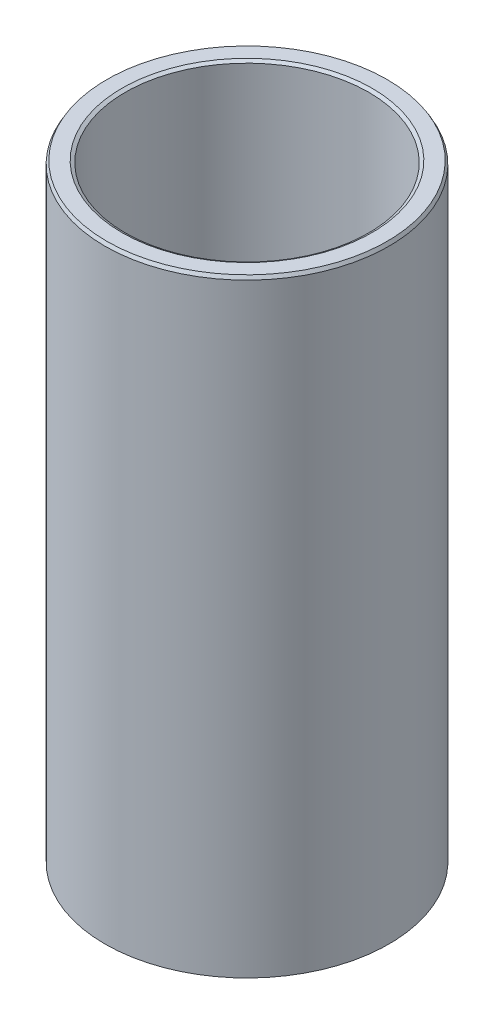
ISO-10303-21;
HEADER;
FILE_DESCRIPTION(('STEP AP214'),'2;1');
FILE_NAME('part.step','',(''),(''),'','','');
FILE_SCHEMA(('AUTOMOTIVE_DESIGN { 1 0 10303 214 1 1 1 1 }'));
ENDSEC;
DATA;
#1=APPLICATION_CONTEXT('core data for automotive mechanical design processes');
#2=APPLICATION_PROTOCOL_DEFINITION('international standard','automotive_design',2000,#1);
#3=PRODUCT_CONTEXT('',#1,'mechanical');
#4=PRODUCT('Part','Part','',(#3));
#5=PRODUCT_RELATED_PRODUCT_CATEGORY('part','',(#4));
#6=PRODUCT_DEFINITION_FORMATION('','',#4);
#7=PRODUCT_DEFINITION_CONTEXT('part definition',#1,'design');
#8=PRODUCT_DEFINITION('design','',#6,#7);
#9=PRODUCT_DEFINITION_SHAPE('','',#8);
#10=(LENGTH_UNIT() NAMED_UNIT(*) SI_UNIT(.MILLI.,.METRE.));
#11=(NAMED_UNIT(*) PLANE_ANGLE_UNIT() SI_UNIT($,.RADIAN.));
#12=(NAMED_UNIT(*) SI_UNIT($,.STERADIAN.) SOLID_ANGLE_UNIT());
#13=UNCERTAINTY_MEASURE_WITH_UNIT(LENGTH_MEASURE(1.E-05),#10,'distance_accuracy_value','');
#14=(GEOMETRIC_REPRESENTATION_CONTEXT(3) GLOBAL_UNCERTAINTY_ASSIGNED_CONTEXT((#13)) GLOBAL_UNIT_ASSIGNED_CONTEXT((#10,
#11,#12)) REPRESENTATION_CONTEXT('',''));
#15=CARTESIAN_POINT('',(0.,0.,0.));
#16=DIRECTION('',(0.,0.,1.));
#17=DIRECTION('',(1.,0.,0.));
#18=AXIS2_PLACEMENT_3D('',#15,#16,#17);
#19=CARTESIAN_POINT('',(0.,236.008714554797,0.));
#20=DIRECTION('',(0.,-1.,0.));
#21=DIRECTION('',(0.,0.,-1.));
#22=AXIS2_PLACEMENT_3D('',#19,#20,#21);
#23=CYLINDRICAL_SURFACE('',#22,55.);
#24=CARTESIAN_POINT('',(0.,0.732950047507397,0.));
#25=DIRECTION('',(0.,1.,0.));
#26=DIRECTION('',(0.,0.,1.));
#27=AXIS2_PLACEMENT_3D('',#24,#25,#26);
#28=CIRCLE('',#27,55.);
#29=CARTESIAN_POINT('',(0.,0.732950047507369,-55.));
#30=VERTEX_POINT('',#29);
#31=EDGE_CURVE('E10',#30,#30,#28,.T.);
#32=CARTESIAN_POINT('',(0.,234.739207833105,0.));
#33=DIRECTION('',(0.,1.,0.));
#34=DIRECTION('',(0.,0.,1.));
#35=AXIS2_PLACEMENT_3D('',#32,#33,#34);
#36=CIRCLE('',#35,55.);
#37=CARTESIAN_POINT('',(0.,234.739207833105,-55.));
#38=VERTEX_POINT('',#37);
#39=EDGE_CURVE('E50',#38,#38,#36,.F.);
#40=CARTESIAN_POINT('',(0.,0.732950047507369,-55.));
#41=CARTESIAN_POINT('',(0.,3.17051523277401,-55.));
#42=CARTESIAN_POINT('',(0.,5.60808041804064,-55.));
#43=CARTESIAN_POINT('',(0.,10.4832107885739,-55.));
#44=CARTESIAN_POINT('',(0.,12.9207759738406,-55.));
#45=CARTESIAN_POINT('',(0.,17.7959063443739,-55.));
#46=CARTESIAN_POINT('',(0.,20.2334715296405,-55.));
#47=CARTESIAN_POINT('',(0.,25.1086019001738,-55.));
#48=CARTESIAN_POINT('',(0.,27.5461670854404,-55.));
#49=CARTESIAN_POINT('',(0.,32.4212974559737,-55.));
#50=CARTESIAN_POINT('',(0.,34.8588626412403,-55.));
#51=CARTESIAN_POINT('',(0.,39.7339930117736,-55.));
#52=CARTESIAN_POINT('',(0.,42.1715581970403,-55.));
#53=CARTESIAN_POINT('',(0.,47.0466885675736,-55.));
#54=CARTESIAN_POINT('',(0.,49.4842537528402,-55.));
#55=CARTESIAN_POINT('',(0.,54.3593841233735,-55.));
#56=CARTESIAN_POINT('',(0.,56.7969493086401,-55.));
#57=CARTESIAN_POINT('',(0.,61.6720796791734,-55.));
#58=CARTESIAN_POINT('',(0.,64.10964486444,-55.));
#59=CARTESIAN_POINT('',(0.,68.9847752349733,-55.));
#60=CARTESIAN_POINT('',(0.,71.42234042024,-55.));
#61=CARTESIAN_POINT('',(0.,76.2974707907733,-55.));
#62=CARTESIAN_POINT('',(0.,78.7350359760399,-55.));
#63=CARTESIAN_POINT('',(0.,83.6101663465732,-55.));
#64=CARTESIAN_POINT('',(0.,86.0477315318398,-55.));
#65=CARTESIAN_POINT('',(0.,90.9228619023731,-55.));
#66=CARTESIAN_POINT('',(0.,93.3604270876397,-55.));
#67=CARTESIAN_POINT('',(0.,98.235557458173,-55.));
#68=CARTESIAN_POINT('',(0.,100.67312264344,-55.));
#69=CARTESIAN_POINT('',(0.,105.548253013973,-55.));
#70=CARTESIAN_POINT('',(0.,107.98581819924,-55.));
#71=CARTESIAN_POINT('',(0.,112.860948569773,-55.));
#72=CARTESIAN_POINT('',(0.,115.298513755039,-55.));
#73=CARTESIAN_POINT('',(0.,120.173644125573,-55.));
#74=CARTESIAN_POINT('',(0.,122.611209310839,-55.));
#75=CARTESIAN_POINT('',(0.,127.486339681373,-55.));
#76=CARTESIAN_POINT('',(0.,129.923904866639,-55.));
#77=CARTESIAN_POINT('',(0.,134.799035237173,-55.));
#78=CARTESIAN_POINT('',(0.,137.236600422439,-55.));
#79=CARTESIAN_POINT('',(0.,142.111730792973,-55.));
#80=CARTESIAN_POINT('',(0.,144.549295978239,-55.));
#81=CARTESIAN_POINT('',(0.,149.424426348772,-55.));
#82=CARTESIAN_POINT('',(0.,151.861991534039,-55.));
#83=CARTESIAN_POINT('',(0.,156.737121904572,-55.));
#84=CARTESIAN_POINT('',(0.,159.174687089839,-55.));
#85=CARTESIAN_POINT('',(0.,164.049817460372,-55.));
#86=CARTESIAN_POINT('',(0.,166.487382645639,-55.));
#87=CARTESIAN_POINT('',(0.,171.362513016172,-55.));
#88=CARTESIAN_POINT('',(0.,173.800078201439,-55.));
#89=CARTESIAN_POINT('',(0.,178.675208571972,-55.));
#90=CARTESIAN_POINT('',(0.,181.112773757239,-55.));
#91=CARTESIAN_POINT('',(0.,185.987904127772,-55.));
#92=CARTESIAN_POINT('',(0.,188.425469313039,-55.));
#93=CARTESIAN_POINT('',(0.,193.300599683572,-55.));
#94=CARTESIAN_POINT('',(0.,195.738164868839,-55.));
#95=CARTESIAN_POINT('',(0.,200.613295239372,-55.));
#96=CARTESIAN_POINT('',(0.,203.050860424639,-55.));
#97=CARTESIAN_POINT('',(0.,207.925990795172,-55.));
#98=CARTESIAN_POINT('',(0.,210.363555980438,-55.));
#99=CARTESIAN_POINT('',(0.,215.238686350972,-55.));
#100=CARTESIAN_POINT('',(0.,217.676251536238,-55.));
#101=CARTESIAN_POINT('',(0.,222.551381906772,-55.));
#102=CARTESIAN_POINT('',(0.,224.988947092038,-55.));
#103=CARTESIAN_POINT('',(0.,229.864077462572,-55.));
#104=CARTESIAN_POINT('',(0.,232.301642647838,-55.));
#105=CARTESIAN_POINT('',(0.,234.739207833105,-55.));
#106=B_SPLINE_CURVE_WITH_KNOTS('',3,(#40,#41,#42,#43,#44,#45,#46,#47,#48,#49,#50,#51,#52,#53,
#54,#55,#56,#57,#58,#59,#60,#61,#62,#63,#64,#65,#66,#67,#68,#69,#70,#71,#72,#73,#74,#75,#76,#77,
#78,#79,#80,#81,#82,#83,#84,#85,#86,#87,#88,#89,#90,#91,#92,#93,#94,#95,#96,#97,#98,#99,#100,
#101,#102,#103,#104,#105),.UNSPECIFIED.,.F.,.F.,(4,2,2,2,2,2,2,2,2,2,2,2,2,2,2,2,2,2,2,2,2,2,2,
2,2,2,2,2,2,2,2,2,4),(0.,7.31269555579991,14.6253911115999,21.9380866673998,29.2507822231997,
36.5634777789996,43.8761733347995,51.1888688905995,58.5015644463994,65.8142600021993,
73.1269555579993,80.4396511137992,87.7523466695991,95.065042225399,102.377737781199,
109.690433336999,117.003128892799,124.315824448599,131.628520004399,138.941215560199,
146.253911115998,153.566606671798,160.879302227598,168.191997783398,175.504693339198,
182.817388894998,190.130084450798,197.442780006598,204.755475562398,212.068171118198,
219.380866673998,226.693562229798,234.006257785598),.UNSPECIFIED.);
#107=EDGE_CURVE('BSEAM39',#30,#38,#106,.T.);
#108=ORIENTED_EDGE('',*,*,#31,.T.);
#109=ORIENTED_EDGE('',*,*,#39,.T.);
#110=ORIENTED_EDGE('',*,*,#107,.T.);
#111=ORIENTED_EDGE('',*,*,#107,.F.);
#112=EDGE_LOOP('',(#108,#110,#109,#111));
#113=FACE_BOUND('',#112,.T.);
#114=ADVANCED_FACE('F39',(#113),#23,.T.);
#115=CARTESIAN_POINT('',(0.,236.008714554797,0.));
#116=DIRECTION('',(0.,1.,0.));
#117=DIRECTION('',(0.,0.,1.));
#118=AXIS2_PLACEMENT_3D('',#115,#116,#117);
#119=PLANE('',#118);
#120=CARTESIAN_POINT('',(0.,236.008714554797,0.));
#121=DIRECTION('',(0.,1.,0.));
#122=DIRECTION('',(0.,0.,1.));
#123=AXIS2_PLACEMENT_3D('',#120,#121,#122);
#124=CIRCLE('',#123,48.429216291663);
#125=CARTESIAN_POINT('',(0.,236.008714554797,48.429216291663));
#126=VERTEX_POINT('',#125);
#127=EDGE_CURVE('E58',#126,#126,#124,.F.);
#128=ORIENTED_EDGE('',*,*,#127,.T.);
#129=EDGE_LOOP('',(#128));
#130=FACE_BOUND('',#129,.T.);
#131=CARTESIAN_POINT('',(0.,236.008714554797,0.));
#132=DIRECTION('',(0.,1.,0.));
#133=DIRECTION('',(0.,0.,1.));
#134=AXIS2_PLACEMENT_3D('',#131,#132,#133);
#135=CIRCLE('',#134,54.2670499524928);
#136=CARTESIAN_POINT('',(0.,236.008714554797,54.2670499524928));
#137=VERTEX_POINT('',#136);
#138=EDGE_CURVE('E61',#137,#137,#135,.T.);
#139=ORIENTED_EDGE('',*,*,#138,.T.);
#140=EDGE_LOOP('',(#139));
#141=FACE_BOUND('',#140,.T.);
#142=ADVANCED_FACE('F88',(#130,#141),#119,.T.);
#143=CARTESIAN_POINT('',(0.,0.,0.));
#144=DIRECTION('',(0.,1.,0.));
#145=DIRECTION('',(0.,0.,1.));
#146=AXIS2_PLACEMENT_3D('',#143,#144,#145);
#147=PLANE('',#146);
#148=CARTESIAN_POINT('',(0.,0.,0.));
#149=DIRECTION('',(0.,1.,0.));
#150=DIRECTION('',(0.,0.,1.));
#151=AXIS2_PLACEMENT_3D('',#148,#149,#150);
#152=CIRCLE('',#151,47.8926596174775);
#153=CARTESIAN_POINT('',(0.,0.,47.8926596174775));
#154=VERTEX_POINT('',#153);
#155=EDGE_CURVE('E51',#154,#154,#152,.T.);
#156=ORIENTED_EDGE('',*,*,#155,.T.);
#157=EDGE_LOOP('',(#156));
#158=FACE_BOUND('',#157,.T.);
#159=CARTESIAN_POINT('',(0.,0.,0.));
#160=DIRECTION('',(0.,1.,0.));
#161=DIRECTION('',(0.,0.,1.));
#162=AXIS2_PLACEMENT_3D('',#159,#160,#161);
#163=CIRCLE('',#162,53.7304932783072);
#164=CARTESIAN_POINT('',(0.,0.,53.7304932783072));
#165=VERTEX_POINT('',#164);
#166=EDGE_CURVE('E54',#165,#165,#163,.F.);
#167=ORIENTED_EDGE('',*,*,#166,.T.);
#168=EDGE_LOOP('',(#167));
#169=FACE_BOUND('',#168,.T.);
#170=ADVANCED_FACE('F83',(#158,#169),#147,.F.);
#171=CARTESIAN_POINT('',(0.,236.008714554797,0.));
#172=DIRECTION('',(0.,-1.,0.));
#173=DIRECTION('',(0.,0.,-1.));
#174=AXIS2_PLACEMENT_3D('',#171,#172,#173);
#175=CYLINDRICAL_SURFACE('',#174,47.1597095699702);
#176=CARTESIAN_POINT('',(0.,235.27576450729,0.));
#177=DIRECTION('',(0.,1.,0.));
#178=DIRECTION('',(0.,0.,1.));
#179=AXIS2_PLACEMENT_3D('',#176,#177,#178);
#180=CIRCLE('',#179,47.1597095699702);
#181=CARTESIAN_POINT('',(0.,235.27576450729,-47.1597095699702));
#182=VERTEX_POINT('',#181);
#183=EDGE_CURVE('E67',#182,#182,#180,.T.);
#184=CARTESIAN_POINT('',(0.,1.26950672169268,0.));
#185=DIRECTION('',(0.,1.,0.));
#186=DIRECTION('',(0.,0.,1.));
#187=AXIS2_PLACEMENT_3D('',#184,#185,#186);
#188=CIRCLE('',#187,47.1597095699702);
#189=CARTESIAN_POINT('',(0.,1.26950672169265,-47.1597095699702));
#190=VERTEX_POINT('',#189);
#191=EDGE_CURVE('E69',#190,#190,#188,.F.);
#192=CARTESIAN_POINT('',(0.,235.27576450729,-47.1597095699702));
#193=CARTESIAN_POINT('',(0.,232.838199322023,-47.1597095699702));
#194=CARTESIAN_POINT('',(0.,230.400634136757,-47.1597095699702));
#195=CARTESIAN_POINT('',(0.,225.525503766223,-47.1597095699702));
#196=CARTESIAN_POINT('',(0.,223.087938580957,-47.1597095699702));
#197=CARTESIAN_POINT('',(0.,218.212808210424,-47.1597095699702));
#198=CARTESIAN_POINT('',(0.,215.775243025157,-47.1597095699702));
#199=CARTESIAN_POINT('',(0.,210.900112654624,-47.1597095699702));
#200=CARTESIAN_POINT('',(0.,208.462547469357,-47.1597095699702));
#201=CARTESIAN_POINT('',(0.,203.587417098824,-47.1597095699702));
#202=CARTESIAN_POINT('',(0.,201.149851913557,-47.1597095699702));
#203=CARTESIAN_POINT('',(0.,196.274721543024,-47.1597095699702));
#204=CARTESIAN_POINT('',(0.,193.837156357757,-47.1597095699702));
#205=CARTESIAN_POINT('',(0.,188.962025987224,-47.1597095699702));
#206=CARTESIAN_POINT('',(0.,186.524460801957,-47.1597095699702));
#207=CARTESIAN_POINT('',(0.,181.649330431424,-47.1597095699702));
#208=CARTESIAN_POINT('',(0.,179.211765246157,-47.1597095699702));
#209=CARTESIAN_POINT('',(0.,174.336634875624,-47.1597095699702));
#210=CARTESIAN_POINT('',(0.,171.899069690357,-47.1597095699702));
#211=CARTESIAN_POINT('',(0.,167.023939319824,-47.1597095699702));
#212=CARTESIAN_POINT('',(0.,164.586374134557,-47.1597095699702));
#213=CARTESIAN_POINT('',(0.,159.711243764024,-47.1597095699702));
#214=CARTESIAN_POINT('',(0.,157.273678578758,-47.1597095699702));
#215=CARTESIAN_POINT('',(0.,152.398548208224,-47.1597095699702));
#216=CARTESIAN_POINT('',(0.,149.960983022958,-47.1597095699702));
#217=CARTESIAN_POINT('',(0.,145.085852652424,-47.1597095699702));
#218=CARTESIAN_POINT('',(0.,142.648287467158,-47.1597095699702));
#219=CARTESIAN_POINT('',(0.,137.773157096624,-47.1597095699702));
#220=CARTESIAN_POINT('',(0.,135.335591911358,-47.1597095699702));
#221=CARTESIAN_POINT('',(0.,130.460461540825,-47.1597095699702));
#222=CARTESIAN_POINT('',(0.,128.022896355558,-47.1597095699702));
#223=CARTESIAN_POINT('',(0.,123.147765985025,-47.1597095699702));
#224=CARTESIAN_POINT('',(0.,120.710200799758,-47.1597095699702));
#225=CARTESIAN_POINT('',(0.,115.835070429225,-47.1597095699702));
#226=CARTESIAN_POINT('',(0.,113.397505243958,-47.1597095699702));
#227=CARTESIAN_POINT('',(0.,108.522374873425,-47.1597095699702));
#228=CARTESIAN_POINT('',(0.,106.084809688158,-47.1597095699702));
#229=CARTESIAN_POINT('',(0.,101.209679317625,-47.1597095699702));
#230=CARTESIAN_POINT('',(0.,98.7721141323582,-47.1597095699702));
#231=CARTESIAN_POINT('',(0.,93.896983761825,-47.1597095699702));
#232=CARTESIAN_POINT('',(0.,91.4594185765583,-47.1597095699702));
#233=CARTESIAN_POINT('',(0.,86.584288206025,-47.1597095699702));
#234=CARTESIAN_POINT('',(0.,84.1467230207584,-47.1597095699702));
#235=CARTESIAN_POINT('',(0.,79.2715926502251,-47.1597095699702));
#236=CARTESIAN_POINT('',(0.,76.8340274649585,-47.1597095699702));
#237=CARTESIAN_POINT('',(0.,71.9588970944252,-47.1597095699702));
#238=CARTESIAN_POINT('',(0.,69.5213319091586,-47.1597095699702));
#239=CARTESIAN_POINT('',(0.,64.6462015386253,-47.1597095699702));
#240=CARTESIAN_POINT('',(0.,62.2086363533586,-47.1597095699702));
#241=CARTESIAN_POINT('',(0.,57.3335059828254,-47.1597095699702));
#242=CARTESIAN_POINT('',(0.,54.8959407975587,-47.1597095699702));
#243=CARTESIAN_POINT('',(0.,50.0208104270254,-47.1597095699702));
#244=CARTESIAN_POINT('',(0.,47.5832452417588,-47.1597095699702));
#245=CARTESIAN_POINT('',(0.,42.7081148712255,-47.1597095699702));
#246=CARTESIAN_POINT('',(0.,40.2705496859589,-47.1597095699702));
#247=CARTESIAN_POINT('',(0.,35.3954193154256,-47.1597095699702));
#248=CARTESIAN_POINT('',(0.,32.957854130159,-47.1597095699702));
#249=CARTESIAN_POINT('',(0.,28.0827237596257,-47.1597095699702));
#250=CARTESIAN_POINT('',(0.,25.645158574359,-47.1597095699702));
#251=CARTESIAN_POINT('',(0.,20.7700282038258,-47.1597095699702));
#252=CARTESIAN_POINT('',(0.,18.3324630185591,-47.1597095699702));
#253=CARTESIAN_POINT('',(0.,13.4573326480258,-47.1597095699702));
#254=CARTESIAN_POINT('',(0.,11.0197674627592,-47.1597095699702));
#255=CARTESIAN_POINT('',(0.,6.14463709222593,-47.1597095699702));
#256=CARTESIAN_POINT('',(0.,3.70707190695929,-47.1597095699702));
#257=CARTESIAN_POINT('',(0.,1.26950672169265,-47.1597095699702));
#258=B_SPLINE_CURVE_WITH_KNOTS('',3,(#192,#193,#194,#195,#196,#197,#198,#199,#200,#201,#202,
#203,#204,#205,#206,#207,#208,#209,#210,#211,#212,#213,#214,#215,#216,#217,#218,#219,#220,#221,
#222,#223,#224,#225,#226,#227,#228,#229,#230,#231,#232,#233,#234,#235,#236,#237,#238,#239,#240,
#241,#242,#243,#244,#245,#246,#247,#248,#249,#250,#251,#252,#253,#254,#255,#256,#257),
.UNSPECIFIED.,.F.,.F.,(4,2,2,2,2,2,2,2,2,2,2,2,2,2,2,2,2,2,2,2,2,2,2,2,2,2,2,2,2,2,2,2,4),(0.,
7.31269555579991,14.6253911115998,21.9380866673997,29.2507822231997,36.5634777789996,
43.8761733347995,51.1888688905994,58.5015644463993,65.8142600021992,73.1269555579992,
80.4396511137991,87.752346669599,95.0650422253989,102.377737781199,109.690433336999,
117.003128892799,124.315824448599,131.628520004398,138.941215560198,146.253911115998,
153.566606671798,160.879302227598,168.191997783398,175.504693339198,182.817388894998,
190.130084450798,197.442780006598,204.755475562398,212.068171118198,219.380866673998,
226.693562229797,234.006257785597),.UNSPECIFIED.);
#259=EDGE_CURVE('BSEAM71',#182,#190,#258,.T.);
#260=ORIENTED_EDGE('',*,*,#183,.T.);
#261=ORIENTED_EDGE('',*,*,#191,.T.);
#262=ORIENTED_EDGE('',*,*,#259,.T.);
#263=ORIENTED_EDGE('',*,*,#259,.F.);
#264=EDGE_LOOP('',(#260,#262,#261,#263));
#265=FACE_BOUND('',#264,.T.);
#266=ADVANCED_FACE('F71',(#265),#175,.F.);
#267=CARTESIAN_POINT('',(0.,235.27576450729,0.));
#268=DIRECTION('',(0.,1.,0.));
#269=DIRECTION('',(0.,0.,1.));
#270=AXIS2_PLACEMENT_3D('',#267,#268,#269);
#271=CONICAL_SURFACE('',#270,47.1597095699702,1.04719755119659);
#272=ORIENTED_EDGE('',*,*,#127,.F.);
#273=EDGE_LOOP('',(#272));
#274=FACE_BOUND('',#273,.T.);
#275=ORIENTED_EDGE('',*,*,#183,.F.);
#276=EDGE_LOOP('',(#275));
#277=FACE_BOUND('',#276,.T.);
#278=ADVANCED_FACE('F77',(#274,#277),#271,.F.);
#279=CARTESIAN_POINT('',(0.,0.,0.));
#280=DIRECTION('',(0.,-1.,0.));
#281=DIRECTION('',(0.,0.,-1.));
#282=AXIS2_PLACEMENT_3D('',#279,#280,#281);
#283=CONICAL_SURFACE('',#282,47.8926596174775,0.523598775598314);
#284=ORIENTED_EDGE('',*,*,#191,.F.);
#285=EDGE_LOOP('',(#284));
#286=FACE_BOUND('',#285,.T.);
#287=ORIENTED_EDGE('',*,*,#155,.F.);
#288=EDGE_LOOP('',(#287));
#289=FACE_BOUND('',#288,.T.);
#290=ADVANCED_FACE('F73',(#286,#289),#283,.F.);
#291=CARTESIAN_POINT('',(0.,0.732950047507397,0.));
#292=DIRECTION('',(0.,1.,0.));
#293=DIRECTION('',(0.,0.,1.));
#294=AXIS2_PLACEMENT_3D('',#291,#292,#293);
#295=CONICAL_SURFACE('',#294,55.,1.04719755119659);
#296=ORIENTED_EDGE('',*,*,#166,.F.);
#297=EDGE_LOOP('',(#296));
#298=FACE_BOUND('',#297,.T.);
#299=ORIENTED_EDGE('',*,*,#31,.F.);
#300=EDGE_LOOP('',(#299));
#301=FACE_BOUND('',#300,.T.);
#302=ADVANCED_FACE('F76',(#298,#301),#295,.T.);
#303=CARTESIAN_POINT('',(0.,236.008714554797,0.));
#304=DIRECTION('',(0.,-1.,0.));
#305=DIRECTION('',(0.,0.,-1.));
#306=AXIS2_PLACEMENT_3D('',#303,#304,#305);
#307=CONICAL_SURFACE('',#306,54.2670499524928,0.523598775598301);
#308=ORIENTED_EDGE('',*,*,#39,.F.);
#309=EDGE_LOOP('',(#308));
#310=FACE_BOUND('',#309,.T.);
#311=ORIENTED_EDGE('',*,*,#138,.F.);
#312=EDGE_LOOP('',(#311));
#313=FACE_BOUND('',#312,.T.);
#314=ADVANCED_FACE('F45',(#310,#313),#307,.T.);
#315=CLOSED_SHELL('',(#114,#142,#170,#266,#278,#290,#302,#314));
#316=MANIFOLD_SOLID_BREP('B2',#315);
#317=ADVANCED_BREP_SHAPE_REPRESENTATION('',(#18,#316),#14);
#318=SHAPE_DEFINITION_REPRESENTATION(#9,#317);
ENDSEC;
END-ISO-10303-21;
